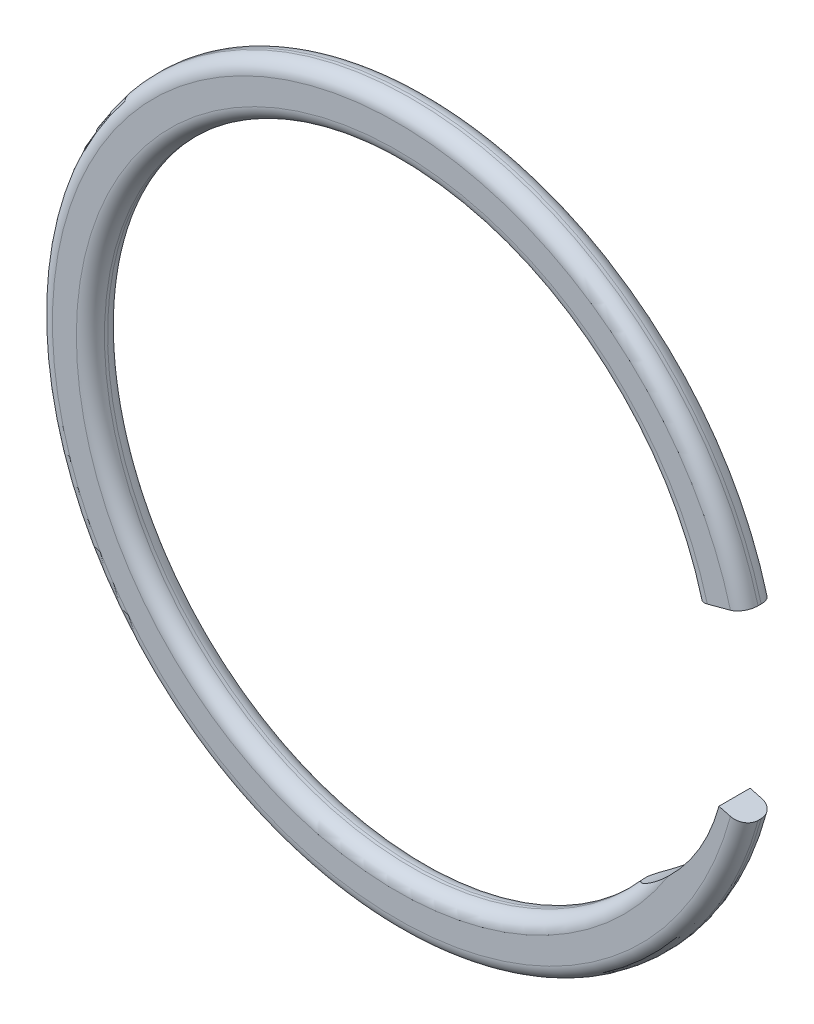
ISO-10303-21;
HEADER;
FILE_DESCRIPTION(('STEP AP214'),'2;1');
FILE_NAME('part.step','',(''),(''),'','','');
FILE_SCHEMA(('AUTOMOTIVE_DESIGN { 1 0 10303 214 1 1 1 1 }'));
ENDSEC;
DATA;
#1=APPLICATION_CONTEXT('core data for automotive mechanical design processes');
#2=APPLICATION_PROTOCOL_DEFINITION('international standard','automotive_design',2000,#1);
#3=PRODUCT_CONTEXT('',#1,'mechanical');
#4=PRODUCT('Part','Part','',(#3));
#5=PRODUCT_RELATED_PRODUCT_CATEGORY('part','',(#4));
#6=PRODUCT_DEFINITION_FORMATION('','',#4);
#7=PRODUCT_DEFINITION_CONTEXT('part definition',#1,'design');
#8=PRODUCT_DEFINITION('design','',#6,#7);
#9=PRODUCT_DEFINITION_SHAPE('','',#8);
#10=(LENGTH_UNIT() NAMED_UNIT(*) SI_UNIT(.MILLI.,.METRE.));
#11=(NAMED_UNIT(*) PLANE_ANGLE_UNIT() SI_UNIT($,.RADIAN.));
#12=(NAMED_UNIT(*) SI_UNIT($,.STERADIAN.) SOLID_ANGLE_UNIT());
#13=UNCERTAINTY_MEASURE_WITH_UNIT(LENGTH_MEASURE(1.E-05),#10,'distance_accuracy_value','');
#14=(GEOMETRIC_REPRESENTATION_CONTEXT(3) GLOBAL_UNCERTAINTY_ASSIGNED_CONTEXT((#13)) GLOBAL_UNIT_ASSIGNED_CONTEXT((#10,
#11,#12)) REPRESENTATION_CONTEXT('',''));
#15=CARTESIAN_POINT('',(0.,0.,0.));
#16=DIRECTION('',(0.,0.,1.));
#17=DIRECTION('',(1.,0.,0.));
#18=AXIS2_PLACEMENT_3D('',#15,#16,#17);
#19=CARTESIAN_POINT('',(0.,0.,0.1524));
#20=DIRECTION('',(0.,0.,-1.));
#21=DIRECTION('',(-1.,0.,0.));
#22=AXIS2_PLACEMENT_3D('',#19,#20,#21);
#23=CYLINDRICAL_SURFACE('',#22,2.9972);
#24=DIRECTION('',(0.,0.,-1.));
#25=VECTOR('',#24,1.);
#26=CARTESIAN_POINT('',(2.26484160822436,-1.96308439188326,0.1524));
#27=LINE('',#26,#25);
#28=CARTESIAN_POINT('',(2.26484160822436,-1.96308439188326,0.01524));
#29=VERTEX_POINT('',#28);
#30=CARTESIAN_POINT('',(2.26484160822436,-1.96308439188326,-0.01524));
#31=VERTEX_POINT('',#30);
#32=EDGE_CURVE('E126',#29,#31,#27,.T.);
#33=ORIENTED_EDGE('',*,*,#32,.T.);
#34=CARTESIAN_POINT('',(0.,0.,-0.01524));
#35=DIRECTION('',(0.,0.,1.));
#36=DIRECTION('',(1.,0.,0.));
#37=AXIS2_PLACEMENT_3D('',#34,#35,#36);
#38=CIRCLE('',#37,2.9972);
#39=CARTESIAN_POINT('',(2.89507288655359,0.775732441981277,-0.01524));
#40=VERTEX_POINT('',#39);
#41=EDGE_CURVE('E152',#31,#40,#38,.F.);
#42=ORIENTED_EDGE('',*,*,#41,.T.);
#43=DIRECTION('',(0.,0.,-1.));
#44=VECTOR('',#43,1.);
#45=CARTESIAN_POINT('',(2.89507288655359,0.775732441981277,0.1524));
#46=LINE('',#45,#44);
#47=CARTESIAN_POINT('',(2.89507288655359,0.775732441981277,0.01524));
#48=VERTEX_POINT('',#47);
#49=EDGE_CURVE('E147',#48,#40,#46,.T.);
#50=ORIENTED_EDGE('',*,*,#49,.F.);
#51=CARTESIAN_POINT('',(0.,0.,0.01524));
#52=DIRECTION('',(0.,0.,1.));
#53=DIRECTION('',(1.,0.,0.));
#54=AXIS2_PLACEMENT_3D('',#51,#52,#53);
#55=CIRCLE('',#54,2.9972);
#56=EDGE_CURVE('E150',#48,#29,#55,.T.);
#57=ORIENTED_EDGE('',*,*,#56,.T.);
#58=EDGE_LOOP('',(#33,#42,#50,#57));
#59=FACE_BOUND('',#58,.T.);
#60=ADVANCED_FACE('F35',(#59),#23,.F.);
#61=CARTESIAN_POINT('',(2.89507288655359,0.775732441981277,0.1524));
#62=DIRECTION('',(-0.258819045102521,0.965925826289068,0.));
#63=DIRECTION('',(-0.965925826289068,-0.258819045102521,0.));
#64=AXIS2_PLACEMENT_3D('',#61,#62,#63);
#65=PLANE('',#64);
#66=ORIENTED_EDGE('',*,*,#49,.T.);
#67=CARTESIAN_POINT('',(3.0275592728874,0.811232062207537,-0.01524));
#68=DIRECTION('',(-0.258819045102521,0.965925826289068,0.));
#69=DIRECTION('',(-0.965925826289068,-0.258819045102521,0.));
#70=AXIS2_PLACEMENT_3D('',#67,#68,#69);
#71=CIRCLE('',#70,0.13716);
#72=CARTESIAN_POINT('',(3.0275592728874,0.811232062207539,-0.1524));
#73=VERTEX_POINT('',#72);
#74=EDGE_CURVE('E161',#40,#73,#71,.F.);
#75=ORIENTED_EDGE('',*,*,#74,.T.);
#76=DIRECTION('',(0.965925826289068,0.258819045102521,0.));
#77=VECTOR('',#76,1.);
#78=CARTESIAN_POINT('',(2.89507288655359,0.775732441981277,-0.1524));
#79=LINE('',#78,#77);
#80=CARTESIAN_POINT('',(3.25327681997463,0.871712896667097,-0.1524));
#81=VERTEX_POINT('',#80);
#82=EDGE_CURVE('E137',#73,#81,#79,.T.);
#83=ORIENTED_EDGE('',*,*,#82,.T.);
#84=CARTESIAN_POINT('',(3.25327681997463,0.871712896667096,-0.01524));
#85=DIRECTION('',(-0.258819045102521,0.965925826289068,0.));
#86=DIRECTION('',(-0.965925826289068,-0.258819045102521,0.));
#87=AXIS2_PLACEMENT_3D('',#84,#85,#86);
#88=CIRCLE('',#87,0.13716);
#89=CARTESIAN_POINT('',(3.38576320630844,0.907212516893359,-0.01524));
#90=VERTEX_POINT('',#89);
#91=EDGE_CURVE('E157',#81,#90,#88,.F.);
#92=ORIENTED_EDGE('',*,*,#91,.T.);
#93=DIRECTION('',(0.,0.,-1.));
#94=VECTOR('',#93,1.);
#95=CARTESIAN_POINT('',(3.38576320630844,0.907212516893359,0.1524));
#96=LINE('',#95,#94);
#97=CARTESIAN_POINT('',(3.38576320630844,0.907212516893359,0.01524));
#98=VERTEX_POINT('',#97);
#99=EDGE_CURVE('E144',#98,#90,#96,.T.);
#100=ORIENTED_EDGE('',*,*,#99,.F.);
#101=CARTESIAN_POINT('',(3.25327681997463,0.871712896667096,0.01524));
#102=DIRECTION('',(-0.258819045102521,0.965925826289068,0.));
#103=DIRECTION('',(-0.965925826289068,-0.258819045102521,0.));
#104=AXIS2_PLACEMENT_3D('',#101,#102,#103);
#105=CIRCLE('',#104,0.13716);
#106=CARTESIAN_POINT('',(3.25327681997463,0.871712896667097,0.1524));
#107=VERTEX_POINT('',#106);
#108=EDGE_CURVE('E155',#98,#107,#105,.F.);
#109=ORIENTED_EDGE('',*,*,#108,.T.);
#110=DIRECTION('',(0.965925826289068,0.258819045102521,0.));
#111=VECTOR('',#110,1.);
#112=CARTESIAN_POINT('',(2.89507288655359,0.775732441981277,0.1524));
#113=LINE('',#112,#111);
#114=CARTESIAN_POINT('',(3.0275592728874,0.811232062207539,0.1524));
#115=VERTEX_POINT('',#114);
#116=EDGE_CURVE('E115',#115,#107,#113,.T.);
#117=ORIENTED_EDGE('',*,*,#116,.F.);
#118=CARTESIAN_POINT('',(3.0275592728874,0.811232062207537,0.01524));
#119=DIRECTION('',(-0.258819045102521,0.965925826289068,0.));
#120=DIRECTION('',(-0.965925826289068,-0.258819045102521,0.));
#121=AXIS2_PLACEMENT_3D('',#118,#119,#120);
#122=CIRCLE('',#121,0.13716);
#123=EDGE_CURVE('E159',#115,#48,#122,.F.);
#124=ORIENTED_EDGE('',*,*,#123,.T.);
#125=EDGE_LOOP('',(#66,#75,#83,#92,#100,#109,#117,#124));
#126=FACE_BOUND('',#125,.T.);
#127=ADVANCED_FACE('F195',(#126),#65,.F.);
#128=CARTESIAN_POINT('',(0.,0.,0.1524));
#129=DIRECTION('',(0.,0.,-1.));
#130=DIRECTION('',(-1.,0.,0.));
#131=AXIS2_PLACEMENT_3D('',#128,#129,#130);
#132=CYLINDRICAL_SURFACE('',#131,3.5052);
#133=ORIENTED_EDGE('',*,*,#99,.T.);
#134=CARTESIAN_POINT('',(0.,0.,-0.01524));
#135=DIRECTION('',(0.,0.,1.));
#136=DIRECTION('',(1.,0.,0.));
#137=AXIS2_PLACEMENT_3D('',#134,#135,#136);
#138=CIRCLE('',#137,3.5052);
#139=CARTESIAN_POINT('',(3.38576320630844,-0.907212516893359,-0.01524));
#140=VERTEX_POINT('',#139);
#141=EDGE_CURVE('E221',#90,#140,#138,.T.);
#142=ORIENTED_EDGE('',*,*,#141,.T.);
#143=DIRECTION('',(0.,0.,-1.));
#144=VECTOR('',#143,1.);
#145=CARTESIAN_POINT('',(3.38576320630844,-0.907212516893359,0.1524));
#146=LINE('',#145,#144);
#147=CARTESIAN_POINT('',(3.38576320630844,-0.907212516893359,0.01524));
#148=VERTEX_POINT('',#147);
#149=EDGE_CURVE('E125',#148,#140,#146,.T.);
#150=ORIENTED_EDGE('',*,*,#149,.F.);
#151=CARTESIAN_POINT('',(0.,0.,0.01524));
#152=DIRECTION('',(0.,0.,1.));
#153=DIRECTION('',(1.,0.,0.));
#154=AXIS2_PLACEMENT_3D('',#151,#152,#153);
#155=CIRCLE('',#154,3.5052);
#156=EDGE_CURVE('E217',#148,#98,#155,.F.);
#157=ORIENTED_EDGE('',*,*,#156,.T.);
#158=EDGE_LOOP('',(#133,#142,#150,#157));
#159=FACE_BOUND('',#158,.T.);
#160=ADVANCED_FACE('F192',(#159),#132,.T.);
#161=CARTESIAN_POINT('',(3.14041804643101,-0.841472479437315,0.1524));
#162=DIRECTION('',(-0.258819045102526,-0.965925826289067,0.));
#163=DIRECTION('',(0.965925826289067,-0.258819045102526,0.));
#164=AXIS2_PLACEMENT_3D('',#161,#162,#163);
#165=PLANE('',#164);
#166=ORIENTED_EDGE('',*,*,#149,.T.);
#167=CARTESIAN_POINT('',(3.25327681997463,-0.871712896667111,-0.01524));
#168=DIRECTION('',(-0.258819045102526,-0.965925826289067,0.));
#169=DIRECTION('',(0.965925826289067,-0.258819045102526,0.));
#170=AXIS2_PLACEMENT_3D('',#167,#168,#169);
#171=CIRCLE('',#170,0.13716);
#172=CARTESIAN_POINT('',(3.25327681997463,-0.871712896667097,-0.1524));
#173=VERTEX_POINT('',#172);
#174=EDGE_CURVE('E11',#140,#173,#171,.F.);
#175=ORIENTED_EDGE('',*,*,#174,.T.);
#176=DIRECTION('',(-0.965925826289067,0.258819045102526,0.));
#177=VECTOR('',#176,1.);
#178=CARTESIAN_POINT('',(3.14041804643101,-0.841472479437315,-0.1524));
#179=LINE('',#178,#177);
#180=CARTESIAN_POINT('',(3.14041804643101,-0.841472479437316,-0.1524));
#181=VERTEX_POINT('',#180);
#182=EDGE_CURVE('E121',#173,#181,#179,.T.);
#183=ORIENTED_EDGE('',*,*,#182,.T.);
#184=DIRECTION('',(0.,0.,-1.));
#185=VECTOR('',#184,1.);
#186=CARTESIAN_POINT('',(3.14041804643101,-0.841472479437316,0.1524));
#187=LINE('',#186,#185);
#188=CARTESIAN_POINT('',(3.14041804643101,-0.841472479437316,0.1524));
#189=VERTEX_POINT('',#188);
#190=EDGE_CURVE('E118',#189,#181,#187,.T.);
#191=ORIENTED_EDGE('',*,*,#190,.F.);
#192=DIRECTION('',(-0.965925826289067,0.258819045102526,0.));
#193=VECTOR('',#192,1.);
#194=CARTESIAN_POINT('',(3.14041804643101,-0.841472479437315,0.1524));
#195=LINE('',#194,#193);
#196=CARTESIAN_POINT('',(3.25327681997463,-0.871712896667097,0.1524));
#197=VERTEX_POINT('',#196);
#198=EDGE_CURVE('E105',#197,#189,#195,.T.);
#199=ORIENTED_EDGE('',*,*,#198,.F.);
#200=CARTESIAN_POINT('',(3.25327681997463,-0.871712896667111,0.01524));
#201=DIRECTION('',(-0.258819045102526,-0.965925826289067,0.));
#202=DIRECTION('',(0.965925826289067,-0.258819045102526,0.));
#203=AXIS2_PLACEMENT_3D('',#200,#201,#202);
#204=CIRCLE('',#203,0.13716);
#205=EDGE_CURVE('E43',#197,#148,#204,.F.);
#206=ORIENTED_EDGE('',*,*,#205,.T.);
#207=EDGE_LOOP('',(#166,#175,#183,#191,#199,#206));
#208=FACE_BOUND('',#207,.T.);
#209=ADVANCED_FACE('F119',(#208),#165,.F.);
#210=CARTESIAN_POINT('',(1.37998195569502,-0.369765050598002,0.1524));
#211=DIRECTION('',(0.,0.,-1.));
#212=DIRECTION('',(-1.,0.,0.));
#213=AXIS2_PLACEMENT_3D('',#210,#211,#212);
#214=CYLINDRICAL_SURFACE('',#213,1.82253755187322);
#215=CARTESIAN_POINT('',(1.37998195569502,-0.369765050598002,-0.1524));
#216=DIRECTION('',(0.,0.,-1.));
#217=DIRECTION('',(1.,0.,0.));
#218=AXIS2_PLACEMENT_3D('',#215,#216,#217);
#219=CIRCLE('',#218,1.82253755187322);
#220=CARTESIAN_POINT('',(2.64491080637335,-1.68186189561731,-0.1524));
#221=VERTEX_POINT('',#220);
#222=EDGE_CURVE('E141',#181,#221,#219,.T.);
#223=ORIENTED_EDGE('',*,*,#222,.T.);
#224=CARTESIAN_POINT('',(2.64491080637335,-1.68186189561731,-0.1524));
#225=CARTESIAN_POINT('',(2.62833367676027,-1.69784462590631,-0.152390576564242));
#226=CARTESIAN_POINT('',(2.61144794189999,-1.71351559655746,-0.152078466779747));
#227=CARTESIAN_POINT('',(2.57708026285154,-1.74422126339886,-0.150656492001433));
#228=CARTESIAN_POINT('',(2.55959718722746,-1.75925461567712,-0.149545022857967));
#229=CARTESIAN_POINT('',(2.52414455420132,-1.78858976812249,-0.146332395904494));
#230=CARTESIAN_POINT('',(2.50617561398722,-1.80289243533179,-0.144232442776686));
#231=CARTESIAN_POINT('',(2.46984900829083,-1.83070874948177,-0.138738725788051));
#232=CARTESIAN_POINT('',(2.45149163214385,-1.84422295735836,-0.13534589499128));
#233=CARTESIAN_POINT('',(2.41349081638591,-1.87112143905937,-0.126555487928842));
#234=CARTESIAN_POINT('',(2.39383299118791,-1.8844559169563,-0.121056148478167));
#235=CARTESIAN_POINT('',(2.36342993234133,-1.90424988413722,-0.110061781008798));
#236=CARTESIAN_POINT('',(2.35258290769869,-1.91114469924903,-0.105637580369597));
#237=CARTESIAN_POINT('',(2.33122866897961,-1.92441232225062,-0.0954287090108744));
#238=CARTESIAN_POINT('',(2.32072030071228,-1.93078704993773,-0.0896493781801373));
#239=CARTESIAN_POINT('',(2.30688405024174,-1.93900549620588,-0.0802361434326068));
#240=CARTESIAN_POINT('',(2.30315580327268,-1.94120100421845,-0.077504038210822));
#241=CARTESIAN_POINT('',(2.29589836442935,-1.94544198669058,-0.0716592320287732));
#242=CARTESIAN_POINT('',(2.29236957161101,-1.94748716267048,-0.068545804975521));
#243=CARTESIAN_POINT('',(2.28559655879946,-1.9513847126111,-0.0618244165846978));
#244=CARTESIAN_POINT('',(2.28235596472987,-1.95323467323036,-0.0582113116196079));
#245=CARTESIAN_POINT('',(2.27641852041922,-1.95660346256252,-0.0504232668750699));
#246=CARTESIAN_POINT('',(2.27371968079624,-1.95812350450906,-0.0462504801526281));
#247=CARTESIAN_POINT('',(2.27015431796647,-1.96012306569957,-0.0391830429711556));
#248=CARTESIAN_POINT('',(2.26899394271969,-1.96077166172918,-0.0364858325114067));
#249=CARTESIAN_POINT('',(2.2670626347541,-1.96184928873298,-0.0309170731013142));
#250=CARTESIAN_POINT('',(2.26629050707366,-1.9622789934723,-0.0280460899412135));
#251=CARTESIAN_POINT('',(2.26545206886017,-1.96274525295459,-0.0234993928234954));
#252=CARTESIAN_POINT('',(2.26522455555595,-1.96287167564455,-0.0218614253938025));
#253=CARTESIAN_POINT('',(2.26491873561099,-1.96304155942933,-0.0185627765062654));
#254=CARTESIAN_POINT('',(2.26484085271148,-1.963084784917,-0.0169020439160376));
#255=CARTESIAN_POINT('',(2.26484160822408,-1.96308439188361,-0.0152400000000886));
#256=B_SPLINE_CURVE_WITH_KNOTS('',3,(#224,#225,#226,#227,#228,#229,#230,#231,#232,#233,#234,
#235,#236,#237,#238,#239,#240,#241,#242,#243,#244,#245,#246,#247,#248,#249,#250,#251,#252,#253,
#254,#255),.UNSPECIFIED.,.F.,.F.,(4,2,2,2,2,2,2,2,2,2,2,2,2,2,2,4),(0.,0.0690837718966311,
0.138306568932581,0.20744522053215,0.276534069286487,0.34949773536937,0.390236105427704,
0.430816566544295,0.446153377560802,0.461519859912175,0.477058280182961,0.492538553616455,
0.501529799128873,0.510493199041556,0.515460550261789,0.520441948004215),.UNSPECIFIED.);
#257=EDGE_CURVE('E174',#221,#31,#256,.T.);
#258=ORIENTED_EDGE('',*,*,#257,.T.);
#259=ORIENTED_EDGE('',*,*,#32,.F.);
#260=CARTESIAN_POINT('',(2.26484160822436,-1.96308439188326,0.01524));
#261=CARTESIAN_POINT('',(2.26483361713935,-1.96308858654708,0.0182490512048009));
#262=CARTESIAN_POINT('',(2.26509387217621,-1.96294430870907,0.0212456410566275));
#263=CARTESIAN_POINT('',(2.2660754042019,-1.96239872852739,0.027099152420001));
#264=CARTESIAN_POINT('',(2.26679056220446,-1.96200083744002,0.0299573938921158));
#265=CARTESIAN_POINT('',(2.26883077630924,-1.96086293029421,0.036175923684687));
#266=CARTESIAN_POINT('',(2.27026175865733,-1.96006330107863,0.0394896007123384));
#267=CARTESIAN_POINT('',(2.27356694668231,-1.95820851822121,0.045823643392716));
#268=CARTESIAN_POINT('',(2.27544355093159,-1.95715198099934,0.0488422924068294));
#269=CARTESIAN_POINT('',(2.28086883224588,-1.95408222302547,0.0565155622120724));
#270=CARTESIAN_POINT('',(2.28469343550413,-1.95190336919708,0.0609056356555873));
#271=CARTESIAN_POINT('',(2.29281823972043,-1.947229973163,0.0690121359673536));
#272=CARTESIAN_POINT('',(2.29711940847991,-1.94473478701716,0.072727150024211));
#273=CARTESIAN_POINT('',(2.3133563679196,-1.9352168162344,0.0853949739053647));
#274=CARTESIAN_POINT('',(2.32610516670181,-1.92755856787671,0.0927967158431964));
#275=CARTESIAN_POINT('',(2.35211708002929,-1.91146464569642,0.105558425437175));
#276=CARTESIAN_POINT('',(2.36538294583321,-1.90302434514707,0.110905132903084));
#277=CARTESIAN_POINT('',(2.39809758236662,-1.88159100404784,0.122327708296468));
#278=CARTESIAN_POINT('',(2.41760847931691,-1.86827633304866,0.127625122656268));
#279=CARTESIAN_POINT('',(2.45637944772018,-1.84067711106887,0.136335238770846));
#280=CARTESIAN_POINT('',(2.47563891082033,-1.82639059421974,0.139743984636992));
#281=CARTESIAN_POINT('',(2.51368020126182,-1.79698206550307,0.145182428758307));
#282=CARTESIAN_POINT('',(2.53246240933318,-1.78186075223614,0.147213261757721));
#283=CARTESIAN_POINT('',(2.56945923812642,-1.75084074980742,0.150228304136968));
#284=CARTESIAN_POINT('',(2.58767379066493,-1.73494196784552,0.151212388254378));
#285=CARTESIAN_POINT('',(2.61222336423789,-1.71263701933149,0.151993982061307));
#286=CARTESIAN_POINT('',(2.61883333832672,-1.7065414916774,0.152148545053589));
#287=CARTESIAN_POINT('',(2.63194757456359,-1.69426709504883,0.152351408054503));
#288=CARTESIAN_POINT('',(2.63845205121899,-1.68808845949102,0.152399960597581));
#289=CARTESIAN_POINT('',(2.64491080637335,-1.68186189561731,0.1524));
#290=B_SPLINE_CURVE_WITH_KNOTS('',3,(#260,#261,#262,#263,#264,#265,#266,#267,#268,#269,#270,
#271,#272,#273,#274,#275,#276,#277,#278,#279,#280,#281,#282,#283,#284,#285,#286,#287,#288,#289),
.UNSPECIFIED.,.F.,.F.,(4,2,2,2,2,2,2,2,2,2,2,2,2,2,4),(0.,0.00899242448869047,
0.0178663767288308,0.0288950214674425,0.0399844303393906,0.0585293411842499,0.0771126279843193,
0.126566982184598,0.176335289721829,0.248788075499972,0.321392048210492,0.3939361570024,
0.466488946031771,0.493466286073338,0.520379291187358),.UNSPECIFIED.);
#291=CARTESIAN_POINT('',(2.64491080637335,-1.68186189561731,0.1524));
#292=VERTEX_POINT('',#291);
#293=EDGE_CURVE('E131',#29,#292,#290,.T.);
#294=ORIENTED_EDGE('',*,*,#293,.T.);
#295=CARTESIAN_POINT('',(1.37998195569502,-0.369765050598002,0.1524));
#296=DIRECTION('',(0.,0.,-1.));
#297=DIRECTION('',(1.,0.,0.));
#298=AXIS2_PLACEMENT_3D('',#295,#296,#297);
#299=CIRCLE('',#298,1.82253755187322);
#300=EDGE_CURVE('E110',#189,#292,#299,.T.);
#301=ORIENTED_EDGE('',*,*,#300,.F.);
#302=ORIENTED_EDGE('',*,*,#190,.T.);
#303=EDGE_LOOP('',(#223,#258,#259,#294,#301,#302));
#304=FACE_BOUND('',#303,.T.);
#305=ADVANCED_FACE('F128',(#304),#214,.F.);
#306=CARTESIAN_POINT('',(0.,0.,0.1524));
#307=DIRECTION('',(0.,0.,1.));
#308=DIRECTION('',(1.,0.,0.));
#309=AXIS2_PLACEMENT_3D('',#306,#307,#308);
#310=PLANE('',#309);
#311=ORIENTED_EDGE('',*,*,#300,.T.);
#312=CARTESIAN_POINT('',(0.,0.,0.1524));
#313=DIRECTION('',(0.,0.,1.));
#314=DIRECTION('',(1.,0.,0.));
#315=AXIS2_PLACEMENT_3D('',#312,#313,#314);
#316=CIRCLE('',#315,3.13436);
#317=EDGE_CURVE('E216',#292,#115,#316,.F.);
#318=ORIENTED_EDGE('',*,*,#317,.T.);
#319=ORIENTED_EDGE('',*,*,#116,.T.);
#320=CARTESIAN_POINT('',(0.,0.,0.1524));
#321=DIRECTION('',(0.,0.,1.));
#322=DIRECTION('',(1.,0.,0.));
#323=AXIS2_PLACEMENT_3D('',#320,#321,#322);
#324=CIRCLE('',#323,3.36804);
#325=EDGE_CURVE('E114',#107,#197,#324,.T.);
#326=ORIENTED_EDGE('',*,*,#325,.T.);
#327=ORIENTED_EDGE('',*,*,#198,.T.);
#328=EDGE_LOOP('',(#311,#318,#319,#326,#327));
#329=FACE_BOUND('',#328,.T.);
#330=ADVANCED_FACE('F107',(#329),#310,.T.);
#331=CARTESIAN_POINT('',(0.,0.,-0.1524));
#332=DIRECTION('',(0.,0.,1.));
#333=DIRECTION('',(1.,0.,0.));
#334=AXIS2_PLACEMENT_3D('',#331,#332,#333);
#335=PLANE('',#334);
#336=ORIENTED_EDGE('',*,*,#82,.F.);
#337=CARTESIAN_POINT('',(0.,0.,-0.1524));
#338=DIRECTION('',(0.,0.,1.));
#339=DIRECTION('',(1.,0.,0.));
#340=AXIS2_PLACEMENT_3D('',#337,#338,#339);
#341=CIRCLE('',#340,3.13436);
#342=EDGE_CURVE('E165',#73,#221,#341,.T.);
#343=ORIENTED_EDGE('',*,*,#342,.T.);
#344=ORIENTED_EDGE('',*,*,#222,.F.);
#345=ORIENTED_EDGE('',*,*,#182,.F.);
#346=CARTESIAN_POINT('',(0.,0.,-0.1524));
#347=DIRECTION('',(0.,0.,1.));
#348=DIRECTION('',(1.,0.,0.));
#349=AXIS2_PLACEMENT_3D('',#346,#347,#348);
#350=CIRCLE('',#349,3.36804);
#351=EDGE_CURVE('E163',#173,#81,#350,.F.);
#352=ORIENTED_EDGE('',*,*,#351,.T.);
#353=EDGE_LOOP('',(#336,#343,#344,#345,#352));
#354=FACE_BOUND('',#353,.T.);
#355=ADVANCED_FACE('F187',(#354),#335,.F.);
#356=CARTESIAN_POINT('',(0.,0.,-0.01524));
#357=DIRECTION('',(0.,0.,1.));
#358=DIRECTION('',(1.,0.,0.));
#359=AXIS2_PLACEMENT_3D('',#356,#357,#358);
#360=TOROIDAL_SURFACE('',#359,3.13436,0.13716);
#361=ORIENTED_EDGE('',*,*,#257,.F.);
#362=ORIENTED_EDGE('',*,*,#342,.F.);
#363=ORIENTED_EDGE('',*,*,#74,.F.);
#364=ORIENTED_EDGE('',*,*,#41,.F.);
#365=EDGE_LOOP('',(#361,#362,#363,#364));
#366=FACE_BOUND('',#365,.T.);
#367=ADVANCED_FACE('F202',(#366),#360,.T.);
#368=CARTESIAN_POINT('',(0.,0.,0.01524));
#369=DIRECTION('',(0.,0.,1.));
#370=DIRECTION('',(1.,0.,0.));
#371=AXIS2_PLACEMENT_3D('',#368,#369,#370);
#372=TOROIDAL_SURFACE('',#371,3.13436,0.13716);
#373=ORIENTED_EDGE('',*,*,#293,.F.);
#374=ORIENTED_EDGE('',*,*,#56,.F.);
#375=ORIENTED_EDGE('',*,*,#123,.F.);
#376=ORIENTED_EDGE('',*,*,#317,.F.);
#377=EDGE_LOOP('',(#373,#374,#375,#376));
#378=FACE_BOUND('',#377,.T.);
#379=ADVANCED_FACE('F181',(#378),#372,.T.);
#380=CARTESIAN_POINT('',(0.,0.,-0.01524));
#381=DIRECTION('',(0.,0.,1.));
#382=DIRECTION('',(1.,0.,0.));
#383=AXIS2_PLACEMENT_3D('',#380,#381,#382);
#384=TOROIDAL_SURFACE('',#383,3.36804,0.13716);
#385=ORIENTED_EDGE('',*,*,#91,.F.);
#386=ORIENTED_EDGE('',*,*,#351,.F.);
#387=ORIENTED_EDGE('',*,*,#174,.F.);
#388=ORIENTED_EDGE('',*,*,#141,.F.);
#389=EDGE_LOOP('',(#385,#386,#387,#388));
#390=FACE_BOUND('',#389,.T.);
#391=ADVANCED_FACE('F210',(#390),#384,.T.);
#392=CARTESIAN_POINT('',(0.,0.,0.01524));
#393=DIRECTION('',(0.,0.,1.));
#394=DIRECTION('',(1.,0.,0.));
#395=AXIS2_PLACEMENT_3D('',#392,#393,#394);
#396=TOROIDAL_SURFACE('',#395,3.36804,0.13716);
#397=ORIENTED_EDGE('',*,*,#108,.F.);
#398=ORIENTED_EDGE('',*,*,#156,.F.);
#399=ORIENTED_EDGE('',*,*,#205,.F.);
#400=ORIENTED_EDGE('',*,*,#325,.F.);
#401=EDGE_LOOP('',(#397,#398,#399,#400));
#402=FACE_BOUND('',#401,.T.);
#403=ADVANCED_FACE('F37',(#402),#396,.T.);
#404=CLOSED_SHELL('',(#60,#127,#160,#209,#305,#330,#355,#367,#379,#391,#403));
#405=MANIFOLD_SOLID_BREP('B2',#404);
#406=ADVANCED_BREP_SHAPE_REPRESENTATION('',(#18,#405),#14);
#407=SHAPE_DEFINITION_REPRESENTATION(#9,#406);
ENDSEC;
END-ISO-10303-21;
